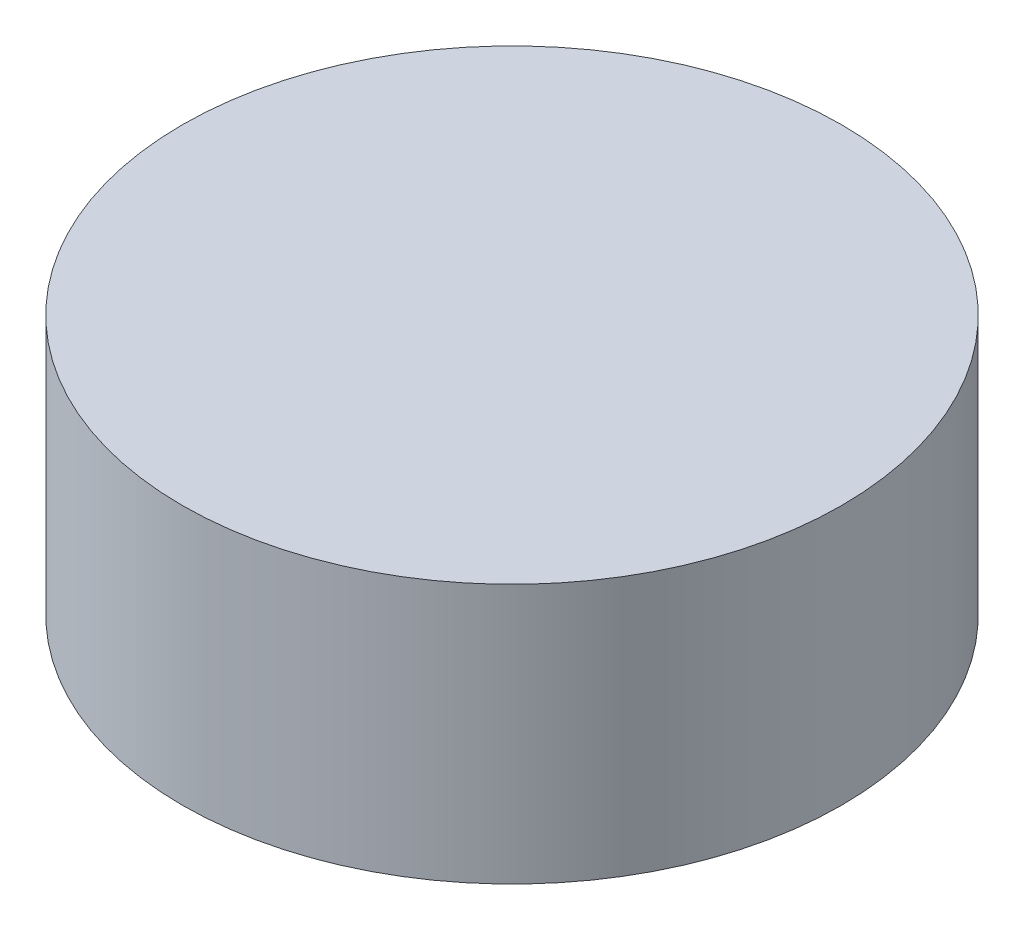
ISO-10303-21;
HEADER;
FILE_DESCRIPTION(('STEP AP214'),'2;1');
FILE_NAME('part.step','',(''),(''),'','','');
FILE_SCHEMA(('AUTOMOTIVE_DESIGN { 1 0 10303 214 1 1 1 1 }'));
ENDSEC;
DATA;
#1=APPLICATION_CONTEXT('core data for automotive mechanical design processes');
#2=APPLICATION_PROTOCOL_DEFINITION('international standard','automotive_design',2000,#1);
#3=PRODUCT_CONTEXT('',#1,'mechanical');
#4=PRODUCT('Part','Part','',(#3));
#5=PRODUCT_RELATED_PRODUCT_CATEGORY('part','',(#4));
#6=PRODUCT_DEFINITION_FORMATION('','',#4);
#7=PRODUCT_DEFINITION_CONTEXT('part definition',#1,'design');
#8=PRODUCT_DEFINITION('design','',#6,#7);
#9=PRODUCT_DEFINITION_SHAPE('','',#8);
#10=(LENGTH_UNIT() NAMED_UNIT(*) SI_UNIT(.MILLI.,.METRE.));
#11=(NAMED_UNIT(*) PLANE_ANGLE_UNIT() SI_UNIT($,.RADIAN.));
#12=(NAMED_UNIT(*) SI_UNIT($,.STERADIAN.) SOLID_ANGLE_UNIT());
#13=UNCERTAINTY_MEASURE_WITH_UNIT(LENGTH_MEASURE(1.E-05),#10,'distance_accuracy_value','');
#14=(GEOMETRIC_REPRESENTATION_CONTEXT(3) GLOBAL_UNCERTAINTY_ASSIGNED_CONTEXT((#13)) GLOBAL_UNIT_ASSIGNED_CONTEXT((#10,
#11,#12)) REPRESENTATION_CONTEXT('',''));
#15=CARTESIAN_POINT('',(0.,0.,0.));
#16=DIRECTION('',(0.,0.,1.));
#17=DIRECTION('',(1.,0.,0.));
#18=AXIS2_PLACEMENT_3D('',#15,#16,#17);
#19=CARTESIAN_POINT('',(0.,10.,0.));
#20=DIRECTION('',(0.,-1.,0.));
#21=DIRECTION('',(0.,0.,-1.));
#22=AXIS2_PLACEMENT_3D('',#19,#20,#21);
#23=CYLINDRICAL_SURFACE('',#22,12.7);
#24=CARTESIAN_POINT('',(0.,10.,0.));
#25=DIRECTION('',(0.,1.,0.));
#26=DIRECTION('',(0.,0.,1.));
#27=AXIS2_PLACEMENT_3D('',#24,#25,#26);
#28=CIRCLE('',#27,12.7);
#29=CARTESIAN_POINT('',(0.,10.,12.7));
#30=VERTEX_POINT('',#29);
#31=EDGE_CURVE('E10',#30,#30,#28,.T.);
#32=ORIENTED_EDGE('',*,*,#31,.F.);
#33=EDGE_LOOP('',(#32));
#34=FACE_BOUND('',#33,.T.);
#35=CARTESIAN_POINT('',(0.,0.,0.));
#36=DIRECTION('',(0.,1.,0.));
#37=DIRECTION('',(0.,0.,1.));
#38=AXIS2_PLACEMENT_3D('',#35,#36,#37);
#39=CIRCLE('',#38,12.7);
#40=CARTESIAN_POINT('',(0.,0.,12.7));
#41=VERTEX_POINT('',#40);
#42=EDGE_CURVE('E37',#41,#41,#39,.T.);
#43=ORIENTED_EDGE('',*,*,#42,.T.);
#44=EDGE_LOOP('',(#43));
#45=FACE_BOUND('',#44,.T.);
#46=ADVANCED_FACE('F34',(#34,#45),#23,.T.);
#47=CARTESIAN_POINT('',(0.,10.,0.));
#48=DIRECTION('',(0.,1.,0.));
#49=DIRECTION('',(0.,0.,1.));
#50=AXIS2_PLACEMENT_3D('',#47,#48,#49);
#51=PLANE('',#50);
#52=ORIENTED_EDGE('',*,*,#31,.T.);
#53=EDGE_LOOP('',(#52));
#54=FACE_BOUND('',#53,.T.);
#55=ADVANCED_FACE('F49',(#54),#51,.T.);
#56=CARTESIAN_POINT('',(0.,0.,0.));
#57=DIRECTION('',(0.,1.,0.));
#58=DIRECTION('',(0.,0.,1.));
#59=AXIS2_PLACEMENT_3D('',#56,#57,#58);
#60=PLANE('',#59);
#61=ORIENTED_EDGE('',*,*,#42,.F.);
#62=EDGE_LOOP('',(#61));
#63=FACE_BOUND('',#62,.T.);
#64=ADVANCED_FACE('F47',(#63),#60,.F.);
#65=CLOSED_SHELL('',(#46,#55,#64));
#66=MANIFOLD_SOLID_BREP('B2',#65);
#67=ADVANCED_BREP_SHAPE_REPRESENTATION('',(#18,#66),#14);
#68=SHAPE_DEFINITION_REPRESENTATION(#9,#67);
ENDSEC;
END-ISO-10303-21;
